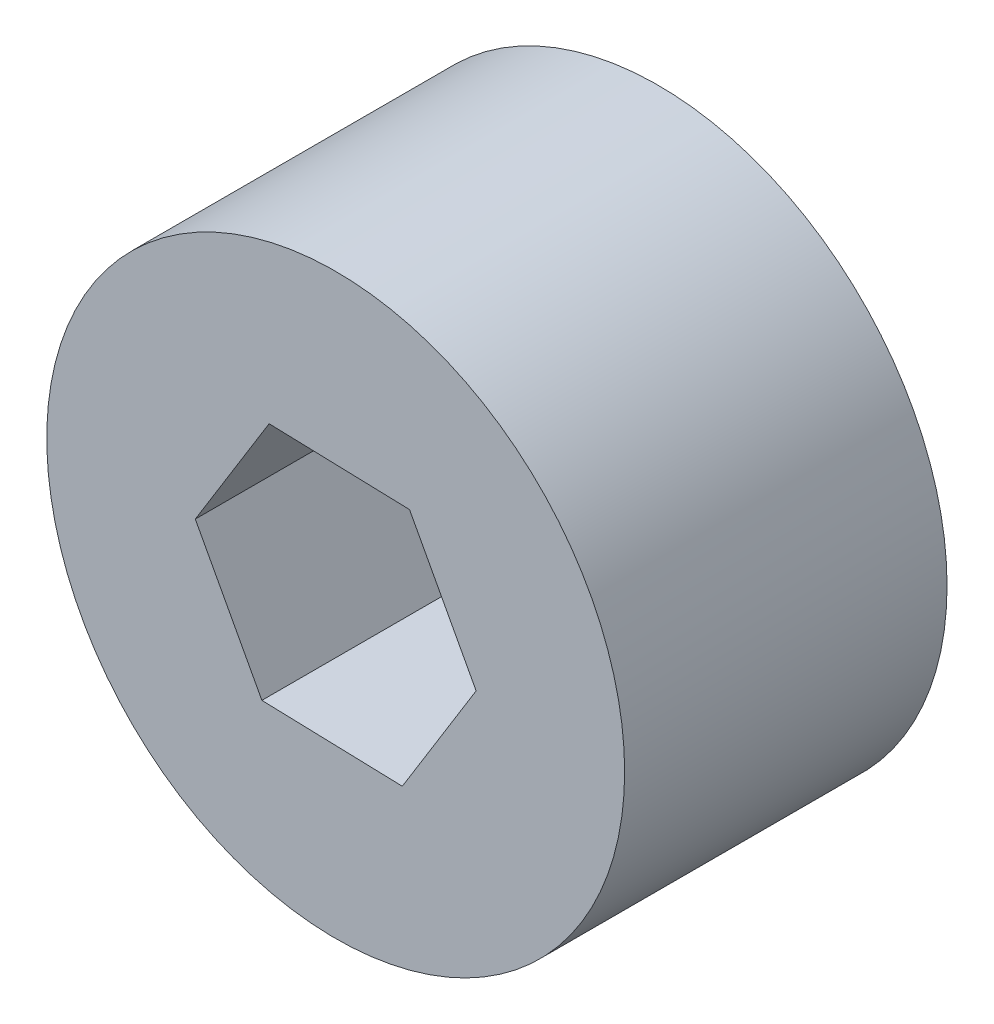
ISO-10303-21;
HEADER;
FILE_DESCRIPTION(('STEP AP214'),'2;1');
FILE_NAME('part.step','',(''),(''),'','','');
FILE_SCHEMA(('AUTOMOTIVE_DESIGN { 1 0 10303 214 1 1 1 1 }'));
ENDSEC;
DATA;
#1=APPLICATION_CONTEXT('core data for automotive mechanical design processes');
#2=APPLICATION_PROTOCOL_DEFINITION('international standard','automotive_design',2000,#1);
#3=PRODUCT_CONTEXT('',#1,'mechanical');
#4=PRODUCT('Part','Part','',(#3));
#5=PRODUCT_RELATED_PRODUCT_CATEGORY('part','',(#4));
#6=PRODUCT_DEFINITION_FORMATION('','',#4);
#7=PRODUCT_DEFINITION_CONTEXT('part definition',#1,'design');
#8=PRODUCT_DEFINITION('design','',#6,#7);
#9=PRODUCT_DEFINITION_SHAPE('','',#8);
#10=(LENGTH_UNIT() NAMED_UNIT(*) SI_UNIT(.MILLI.,.METRE.));
#11=(NAMED_UNIT(*) PLANE_ANGLE_UNIT() SI_UNIT($,.RADIAN.));
#12=(NAMED_UNIT(*) SI_UNIT($,.STERADIAN.) SOLID_ANGLE_UNIT());
#13=UNCERTAINTY_MEASURE_WITH_UNIT(LENGTH_MEASURE(1.E-05),#10,'distance_accuracy_value','');
#14=(GEOMETRIC_REPRESENTATION_CONTEXT(3) GLOBAL_UNCERTAINTY_ASSIGNED_CONTEXT((#13)) GLOBAL_UNIT_ASSIGNED_CONTEXT((#10,
#11,#12)) REPRESENTATION_CONTEXT('',''));
#15=CARTESIAN_POINT('',(0.,0.,0.));
#16=DIRECTION('',(0.,0.,1.));
#17=DIRECTION('',(1.,0.,0.));
#18=AXIS2_PLACEMENT_3D('',#15,#16,#17);
#19=CARTESIAN_POINT('',(0.,0.,16.8275));
#20=DIRECTION('',(0.,0.,1.));
#21=DIRECTION('',(1.,0.,0.));
#22=AXIS2_PLACEMENT_3D('',#19,#20,#21);
#23=PLANE('',#22);
#24=CARTESIAN_POINT('',(0.,0.,16.8275));
#25=DIRECTION('',(0.,0.,1.));
#26=DIRECTION('',(1.,0.,0.));
#27=AXIS2_PLACEMENT_3D('',#24,#25,#26);
#28=CIRCLE('',#27,15.08125);
#29=CARTESIAN_POINT('',(15.08125,0.,16.8275));
#30=VERTEX_POINT('',#29);
#31=EDGE_CURVE('E11',#30,#30,#28,.T.);
#32=ORIENTED_EDGE('',*,*,#31,.T.);
#33=EDGE_LOOP('',(#32));
#34=FACE_BOUND('',#33,.T.);
#35=DIRECTION('',(-0.999559119563031,0.0296911855333937,0.));
#36=VECTOR('',#35,1.);
#37=CARTESIAN_POINT('',(3.85309689300374,6.23834735057757,16.8275));
#38=LINE('',#37,#36);
#39=CARTESIAN_POINT('',(3.85309689300374,6.23834735057757,16.8275));
#40=VERTEX_POINT('',#39);
#41=CARTESIAN_POINT('',(-3.47601883672965,6.45605346787292,16.8275));
#42=VERTEX_POINT('',#41);
#43=EDGE_CURVE('E94',#40,#42,#38,.T.);
#44=ORIENTED_EDGE('',*,*,#43,.F.);
#45=DIRECTION('',(-0.47406623884112,0.880489182892689,0.));
#46=VECTOR('',#45,1.);
#47=CARTESIAN_POINT('',(7.3291157297334,-0.217706117295356,16.8275));
#48=LINE('',#47,#46);
#49=CARTESIAN_POINT('',(7.3291157297334,-0.217706117295356,16.8275));
#50=VERTEX_POINT('',#49);
#51=EDGE_CURVE('E86',#50,#40,#48,.T.);
#52=ORIENTED_EDGE('',*,*,#51,.F.);
#53=DIRECTION('',(0.525492880721912,0.850797997359295,0.));
#54=VECTOR('',#53,1.);
#55=CARTESIAN_POINT('',(3.47601883672965,-6.45605346787292,16.8275));
#56=LINE('',#55,#54);
#57=CARTESIAN_POINT('',(3.47601883672965,-6.45605346787292,16.8275));
#58=VERTEX_POINT('',#57);
#59=EDGE_CURVE('E114',#58,#50,#56,.T.);
#60=ORIENTED_EDGE('',*,*,#59,.F.);
#61=DIRECTION('',(0.999559119563031,-0.0296911855333934,0.));
#62=VECTOR('',#61,1.);
#63=CARTESIAN_POINT('',(-3.85309689300375,-6.23834735057757,16.8275));
#64=LINE('',#63,#62);
#65=CARTESIAN_POINT('',(-3.85309689300375,-6.23834735057757,16.8275));
#66=VERTEX_POINT('',#65);
#67=EDGE_CURVE('E112',#66,#58,#64,.T.);
#68=ORIENTED_EDGE('',*,*,#67,.F.);
#69=DIRECTION('',(0.47406623884112,-0.880489182892689,0.));
#70=VECTOR('',#69,1.);
#71=CARTESIAN_POINT('',(-7.3291157297334,0.217706117295355,16.8275));
#72=LINE('',#71,#70);
#73=CARTESIAN_POINT('',(-7.3291157297334,0.217706117295355,16.8275));
#74=VERTEX_POINT('',#73);
#75=EDGE_CURVE('E108',#74,#66,#72,.T.);
#76=ORIENTED_EDGE('',*,*,#75,.F.);
#77=DIRECTION('',(-0.525492880721911,-0.850797997359295,0.));
#78=VECTOR('',#77,1.);
#79=CARTESIAN_POINT('',(-3.47601883672965,6.45605346787292,16.8275));
#80=LINE('',#79,#78);
#81=EDGE_CURVE('E106',#42,#74,#80,.T.);
#82=ORIENTED_EDGE('',*,*,#81,.F.);
#83=EDGE_LOOP('',(#44,#52,#60,#68,#76,#82));
#84=FACE_BOUND('',#83,.T.);
#85=ADVANCED_FACE('F33',(#34,#84),#23,.T.);
#86=CARTESIAN_POINT('',(0.,0.,0.));
#87=DIRECTION('',(0.,0.,1.));
#88=DIRECTION('',(1.,0.,0.));
#89=AXIS2_PLACEMENT_3D('',#86,#87,#88);
#90=PLANE('',#89);
#91=CARTESIAN_POINT('',(0.,0.,0.));
#92=DIRECTION('',(0.,0.,1.));
#93=DIRECTION('',(1.,0.,0.));
#94=AXIS2_PLACEMENT_3D('',#91,#92,#93);
#95=CIRCLE('',#94,15.08125);
#96=CARTESIAN_POINT('',(15.08125,0.,0.));
#97=VERTEX_POINT('',#96);
#98=EDGE_CURVE('E37',#97,#97,#95,.T.);
#99=ORIENTED_EDGE('',*,*,#98,.F.);
#100=EDGE_LOOP('',(#99));
#101=FACE_BOUND('',#100,.T.);
#102=DIRECTION('',(-0.47406623884112,0.880489182892689,0.));
#103=VECTOR('',#102,1.);
#104=CARTESIAN_POINT('',(7.3291157297334,-0.217706117295356,0.));
#105=LINE('',#104,#103);
#106=CARTESIAN_POINT('',(7.3291157297334,-0.217706117295356,0.));
#107=VERTEX_POINT('',#106);
#108=CARTESIAN_POINT('',(3.85309689300374,6.23834735057757,0.));
#109=VERTEX_POINT('',#108);
#110=EDGE_CURVE('E56',#107,#109,#105,.T.);
#111=ORIENTED_EDGE('',*,*,#110,.T.);
#112=DIRECTION('',(-0.999559119563031,0.0296911855333937,0.));
#113=VECTOR('',#112,1.);
#114=CARTESIAN_POINT('',(3.85309689300374,6.23834735057757,0.));
#115=LINE('',#114,#113);
#116=CARTESIAN_POINT('',(-3.47601883672965,6.45605346787292,0.));
#117=VERTEX_POINT('',#116);
#118=EDGE_CURVE('E101',#109,#117,#115,.T.);
#119=ORIENTED_EDGE('',*,*,#118,.T.);
#120=DIRECTION('',(-0.525492880721911,-0.850797997359295,0.));
#121=VECTOR('',#120,1.);
#122=CARTESIAN_POINT('',(-3.47601883672965,6.45605346787292,0.));
#123=LINE('',#122,#121);
#124=CARTESIAN_POINT('',(-7.3291157297334,0.217706117295355,0.));
#125=VERTEX_POINT('',#124);
#126=EDGE_CURVE('E118',#117,#125,#123,.T.);
#127=ORIENTED_EDGE('',*,*,#126,.T.);
#128=DIRECTION('',(0.47406623884112,-0.880489182892689,0.));
#129=VECTOR('',#128,1.);
#130=CARTESIAN_POINT('',(-7.3291157297334,0.217706117295355,0.));
#131=LINE('',#130,#129);
#132=CARTESIAN_POINT('',(-3.85309689300375,-6.23834735057757,0.));
#133=VERTEX_POINT('',#132);
#134=EDGE_CURVE('E121',#125,#133,#131,.T.);
#135=ORIENTED_EDGE('',*,*,#134,.T.);
#136=DIRECTION('',(0.999559119563031,-0.0296911855333934,0.));
#137=VECTOR('',#136,1.);
#138=CARTESIAN_POINT('',(-3.85309689300375,-6.23834735057757,0.));
#139=LINE('',#138,#137);
#140=CARTESIAN_POINT('',(3.47601883672965,-6.45605346787292,0.));
#141=VERTEX_POINT('',#140);
#142=EDGE_CURVE('E124',#133,#141,#139,.T.);
#143=ORIENTED_EDGE('',*,*,#142,.T.);
#144=DIRECTION('',(0.525492880721912,0.850797997359295,0.));
#145=VECTOR('',#144,1.);
#146=CARTESIAN_POINT('',(3.47601883672965,-6.45605346787292,0.));
#147=LINE('',#146,#145);
#148=EDGE_CURVE('E95',#141,#107,#147,.T.);
#149=ORIENTED_EDGE('',*,*,#148,.T.);
#150=EDGE_LOOP('',(#111,#119,#127,#135,#143,#149));
#151=FACE_BOUND('',#150,.T.);
#152=ADVANCED_FACE('F141',(#101,#151),#90,.F.);
#153=CARTESIAN_POINT('',(0.,0.,16.8275));
#154=DIRECTION('',(0.,0.,-1.));
#155=DIRECTION('',(-1.,0.,0.));
#156=AXIS2_PLACEMENT_3D('',#153,#154,#155);
#157=CYLINDRICAL_SURFACE('',#156,15.08125);
#158=ORIENTED_EDGE('',*,*,#31,.F.);
#159=EDGE_LOOP('',(#158));
#160=FACE_BOUND('',#159,.T.);
#161=ORIENTED_EDGE('',*,*,#98,.T.);
#162=EDGE_LOOP('',(#161));
#163=FACE_BOUND('',#162,.T.);
#164=ADVANCED_FACE('F35',(#160,#163),#157,.T.);
#165=CARTESIAN_POINT('',(7.3291157297334,-0.217706117295356,16.8275));
#166=DIRECTION('',(-0.880489182892689,-0.47406623884112,0.));
#167=DIRECTION('',(0.47406623884112,-0.880489182892689,0.));
#168=AXIS2_PLACEMENT_3D('',#165,#166,#167);
#169=PLANE('',#168);
#170=ORIENTED_EDGE('',*,*,#110,.F.);
#171=DIRECTION('',(0.,0.,-1.));
#172=VECTOR('',#171,1.);
#173=CARTESIAN_POINT('',(7.3291157297334,-0.217706117295356,16.8275));
#174=LINE('',#173,#172);
#175=EDGE_CURVE('E90',#50,#107,#174,.T.);
#176=ORIENTED_EDGE('',*,*,#175,.F.);
#177=ORIENTED_EDGE('',*,*,#51,.T.);
#178=DIRECTION('',(0.,0.,-1.));
#179=VECTOR('',#178,1.);
#180=CARTESIAN_POINT('',(3.85309689300374,6.23834735057757,16.8275));
#181=LINE('',#180,#179);
#182=EDGE_CURVE('E89',#40,#109,#181,.T.);
#183=ORIENTED_EDGE('',*,*,#182,.T.);
#184=EDGE_LOOP('',(#170,#176,#177,#183));
#185=FACE_BOUND('',#184,.T.);
#186=ADVANCED_FACE('F88',(#185),#169,.T.);
#187=CARTESIAN_POINT('',(3.85309689300374,6.23834735057757,16.8275));
#188=DIRECTION('',(-0.0296911855333937,-0.999559119563031,0.));
#189=DIRECTION('',(0.999559119563031,-0.0296911855333937,0.));
#190=AXIS2_PLACEMENT_3D('',#187,#188,#189);
#191=PLANE('',#190);
#192=ORIENTED_EDGE('',*,*,#118,.F.);
#193=ORIENTED_EDGE('',*,*,#182,.F.);
#194=ORIENTED_EDGE('',*,*,#43,.T.);
#195=DIRECTION('',(0.,0.,-1.));
#196=VECTOR('',#195,1.);
#197=CARTESIAN_POINT('',(-3.47601883672965,6.45605346787292,16.8275));
#198=LINE('',#197,#196);
#199=EDGE_CURVE('E102',#42,#117,#198,.T.);
#200=ORIENTED_EDGE('',*,*,#199,.T.);
#201=EDGE_LOOP('',(#192,#193,#194,#200));
#202=FACE_BOUND('',#201,.T.);
#203=ADVANCED_FACE('F98',(#202),#191,.T.);
#204=CARTESIAN_POINT('',(-3.47601883672965,6.45605346787292,16.8275));
#205=DIRECTION('',(0.850797997359295,-0.525492880721911,0.));
#206=DIRECTION('',(0.525492880721911,0.850797997359295,0.));
#207=AXIS2_PLACEMENT_3D('',#204,#205,#206);
#208=PLANE('',#207);
#209=ORIENTED_EDGE('',*,*,#126,.F.);
#210=ORIENTED_EDGE('',*,*,#199,.F.);
#211=ORIENTED_EDGE('',*,*,#81,.T.);
#212=DIRECTION('',(0.,0.,-1.));
#213=VECTOR('',#212,1.);
#214=CARTESIAN_POINT('',(-7.3291157297334,0.217706117295355,16.8275));
#215=LINE('',#214,#213);
#216=EDGE_CURVE('E133',#74,#125,#215,.T.);
#217=ORIENTED_EDGE('',*,*,#216,.T.);
#218=EDGE_LOOP('',(#209,#210,#211,#217));
#219=FACE_BOUND('',#218,.T.);
#220=ADVANCED_FACE('F137',(#219),#208,.T.);
#221=CARTESIAN_POINT('',(-7.3291157297334,0.217706117295355,16.8275));
#222=DIRECTION('',(0.880489182892689,0.47406623884112,0.));
#223=DIRECTION('',(-0.47406623884112,0.880489182892689,0.));
#224=AXIS2_PLACEMENT_3D('',#221,#222,#223);
#225=PLANE('',#224);
#226=ORIENTED_EDGE('',*,*,#134,.F.);
#227=ORIENTED_EDGE('',*,*,#216,.F.);
#228=ORIENTED_EDGE('',*,*,#75,.T.);
#229=DIRECTION('',(0.,0.,-1.));
#230=VECTOR('',#229,1.);
#231=CARTESIAN_POINT('',(-3.85309689300375,-6.23834735057757,16.8275));
#232=LINE('',#231,#230);
#233=EDGE_CURVE('E131',#66,#133,#232,.T.);
#234=ORIENTED_EDGE('',*,*,#233,.T.);
#235=EDGE_LOOP('',(#226,#227,#228,#234));
#236=FACE_BOUND('',#235,.T.);
#237=ADVANCED_FACE('F149',(#236),#225,.T.);
#238=CARTESIAN_POINT('',(-3.85309689300375,-6.23834735057757,16.8275));
#239=DIRECTION('',(0.0296911855333934,0.999559119563031,0.));
#240=DIRECTION('',(-0.999559119563031,0.0296911855333934,0.));
#241=AXIS2_PLACEMENT_3D('',#238,#239,#240);
#242=PLANE('',#241);
#243=ORIENTED_EDGE('',*,*,#142,.F.);
#244=ORIENTED_EDGE('',*,*,#233,.F.);
#245=ORIENTED_EDGE('',*,*,#67,.T.);
#246=DIRECTION('',(0.,0.,-1.));
#247=VECTOR('',#246,1.);
#248=CARTESIAN_POINT('',(3.47601883672965,-6.45605346787292,16.8275));
#249=LINE('',#248,#247);
#250=EDGE_CURVE('E48',#58,#141,#249,.T.);
#251=ORIENTED_EDGE('',*,*,#250,.T.);
#252=EDGE_LOOP('',(#243,#244,#245,#251));
#253=FACE_BOUND('',#252,.T.);
#254=ADVANCED_FACE('F147',(#253),#242,.T.);
#255=CARTESIAN_POINT('',(3.47601883672965,-6.45605346787292,16.8275));
#256=DIRECTION('',(-0.850797997359295,0.525492880721911,0.));
#257=DIRECTION('',(-0.525492880721912,-0.850797997359295,0.));
#258=AXIS2_PLACEMENT_3D('',#255,#256,#257);
#259=PLANE('',#258);
#260=ORIENTED_EDGE('',*,*,#148,.F.);
#261=ORIENTED_EDGE('',*,*,#250,.F.);
#262=ORIENTED_EDGE('',*,*,#59,.T.);
#263=ORIENTED_EDGE('',*,*,#175,.T.);
#264=EDGE_LOOP('',(#260,#261,#262,#263));
#265=FACE_BOUND('',#264,.T.);
#266=ADVANCED_FACE('F143',(#265),#259,.T.);
#267=CLOSED_SHELL('',(#85,#152,#164,#186,#203,#220,#237,#254,#266));
#268=MANIFOLD_SOLID_BREP('B2',#267);
#269=ADVANCED_BREP_SHAPE_REPRESENTATION('',(#18,#268),#14);
#270=SHAPE_DEFINITION_REPRESENTATION(#9,#269);
ENDSEC;
END-ISO-10303-21;
